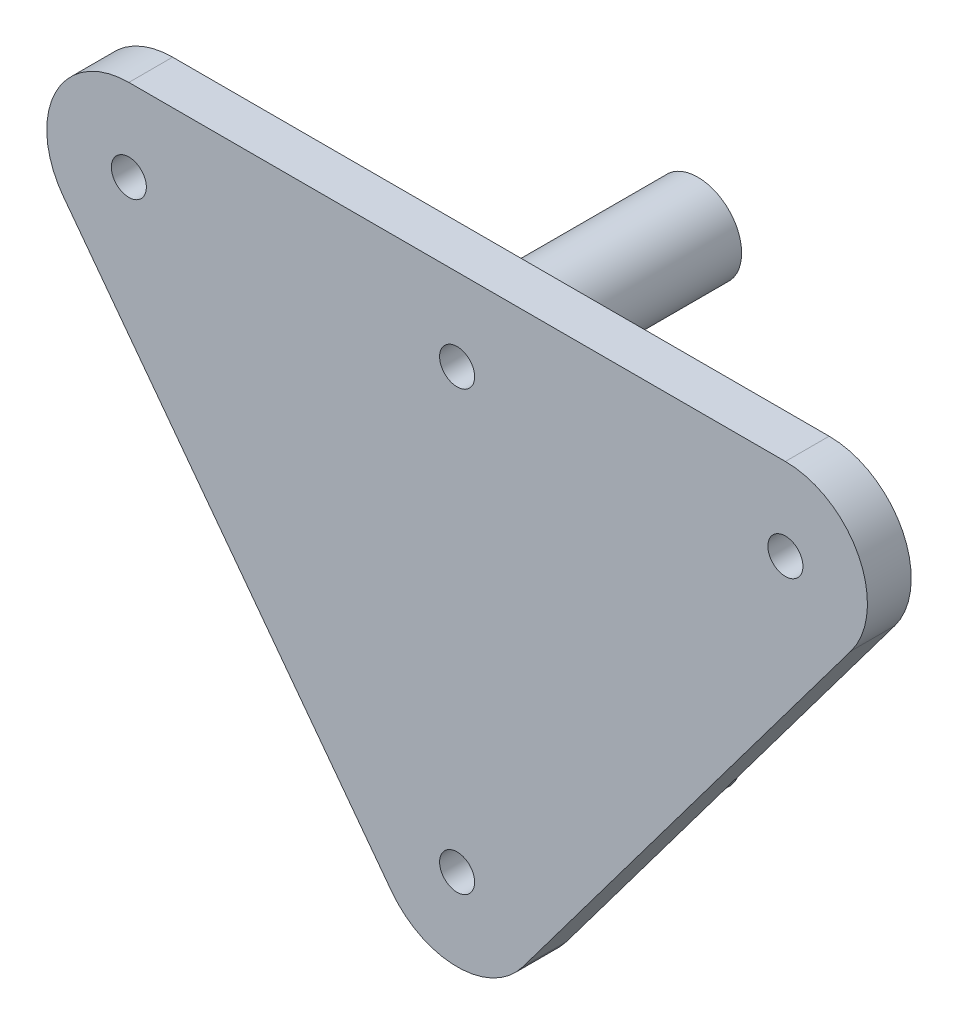
ISO-10303-21;
HEADER;
FILE_DESCRIPTION(('STEP AP214'),'2;1');
FILE_NAME('part.step','',(''),(''),'','','');
FILE_SCHEMA(('AUTOMOTIVE_DESIGN { 1 0 10303 214 1 1 1 1 }'));
ENDSEC;
DATA;
#1=APPLICATION_CONTEXT('core data for automotive mechanical design processes');
#2=APPLICATION_PROTOCOL_DEFINITION('international standard','automotive_design',2000,#1);
#3=PRODUCT_CONTEXT('',#1,'mechanical');
#4=PRODUCT('Part','Part','',(#3));
#5=PRODUCT_RELATED_PRODUCT_CATEGORY('part','',(#4));
#6=PRODUCT_DEFINITION_FORMATION('','',#4);
#7=PRODUCT_DEFINITION_CONTEXT('part definition',#1,'design');
#8=PRODUCT_DEFINITION('design','',#6,#7);
#9=PRODUCT_DEFINITION_SHAPE('','',#8);
#10=(LENGTH_UNIT() NAMED_UNIT(*) SI_UNIT(.MILLI.,.METRE.));
#11=(NAMED_UNIT(*) PLANE_ANGLE_UNIT() SI_UNIT($,.RADIAN.));
#12=(NAMED_UNIT(*) SI_UNIT($,.STERADIAN.) SOLID_ANGLE_UNIT());
#13=UNCERTAINTY_MEASURE_WITH_UNIT(LENGTH_MEASURE(1.E-05),#10,'distance_accuracy_value','');
#14=(GEOMETRIC_REPRESENTATION_CONTEXT(3) GLOBAL_UNCERTAINTY_ASSIGNED_CONTEXT((#13)) GLOBAL_UNIT_ASSIGNED_CONTEXT((#10,
#11,#12)) REPRESENTATION_CONTEXT('',''));
#15=CARTESIAN_POINT('',(0.,0.,0.));
#16=DIRECTION('',(0.,0.,1.));
#17=DIRECTION('',(1.,0.,0.));
#18=AXIS2_PLACEMENT_3D('',#15,#16,#17);
#19=CARTESIAN_POINT('',(0.,0.,0.));
#20=DIRECTION('',(0.,0.,1.));
#21=DIRECTION('',(1.,0.,0.));
#22=AXIS2_PLACEMENT_3D('',#19,#20,#21);
#23=PLANE('',#22);
#24=CARTESIAN_POINT('',(0.,-20.,0.));
#25=DIRECTION('',(0.,0.,1.));
#26=DIRECTION('',(1.,0.,0.));
#27=AXIS2_PLACEMENT_3D('',#24,#25,#26);
#28=CIRCLE('',#27,6.);
#29=CARTESIAN_POINT('',(6.,-20.,0.));
#30=VERTEX_POINT('',#29);
#31=EDGE_CURVE('E163',#30,#30,#28,.T.);
#32=ORIENTED_EDGE('',*,*,#31,.T.);
#33=EDGE_LOOP('',(#32));
#34=FACE_BOUND('',#33,.T.);
#35=CARTESIAN_POINT('',(0.,20.,0.));
#36=DIRECTION('',(0.,0.,1.));
#37=DIRECTION('',(1.,0.,0.));
#38=AXIS2_PLACEMENT_3D('',#35,#36,#37);
#39=CIRCLE('',#38,6.);
#40=CARTESIAN_POINT('',(6.,20.,0.));
#41=VERTEX_POINT('',#40);
#42=EDGE_CURVE('E160',#41,#41,#39,.T.);
#43=ORIENTED_EDGE('',*,*,#42,.T.);
#44=EDGE_LOOP('',(#43));
#45=FACE_BOUND('',#44,.T.);
#46=CARTESIAN_POINT('',(30.,20.,0.));
#47=DIRECTION('',(0.,0.,1.));
#48=DIRECTION('',(1.,0.,0.));
#49=AXIS2_PLACEMENT_3D('',#46,#47,#48);
#50=CIRCLE('',#49,3.6);
#51=CARTESIAN_POINT('',(33.6,20.,0.));
#52=VERTEX_POINT('',#51);
#53=EDGE_CURVE('E154',#52,#52,#50,.F.);
#54=ORIENTED_EDGE('',*,*,#53,.F.);
#55=EDGE_LOOP('',(#54));
#56=FACE_BOUND('',#55,.T.);
#57=CARTESIAN_POINT('',(-30.,20.,0.));
#58=DIRECTION('',(0.,0.,1.));
#59=DIRECTION('',(1.,0.,0.));
#60=AXIS2_PLACEMENT_3D('',#57,#58,#59);
#61=CIRCLE('',#60,7.5);
#62=CARTESIAN_POINT('',(-30.,27.5,0.));
#63=VERTEX_POINT('',#62);
#64=CARTESIAN_POINT('',(-36.,15.5,0.));
#65=VERTEX_POINT('',#64);
#66=EDGE_CURVE('E132',#63,#65,#61,.T.);
#67=ORIENTED_EDGE('',*,*,#66,.F.);
#68=DIRECTION('',(1.,0.,0.));
#69=VECTOR('',#68,1.);
#70=CARTESIAN_POINT('',(0.,27.5,0.));
#71=LINE('',#70,#69);
#72=CARTESIAN_POINT('',(30.,27.5,0.));
#73=VERTEX_POINT('',#72);
#74=EDGE_CURVE('E142',#63,#73,#71,.T.);
#75=ORIENTED_EDGE('',*,*,#74,.T.);
#76=CARTESIAN_POINT('',(30.,20.,0.));
#77=DIRECTION('',(0.,0.,1.));
#78=DIRECTION('',(1.,0.,0.));
#79=AXIS2_PLACEMENT_3D('',#76,#77,#78);
#80=CIRCLE('',#79,7.5);
#81=CARTESIAN_POINT('',(36.,15.5,0.));
#82=VERTEX_POINT('',#81);
#83=EDGE_CURVE('E140',#82,#73,#80,.T.);
#84=ORIENTED_EDGE('',*,*,#83,.F.);
#85=DIRECTION('',(0.6,0.8,0.));
#86=VECTOR('',#85,1.);
#87=CARTESIAN_POINT('',(15.6,-11.7,0.));
#88=LINE('',#87,#86);
#89=CARTESIAN_POINT('',(6.,-24.5,0.));
#90=VERTEX_POINT('',#89);
#91=EDGE_CURVE('E112',#90,#82,#88,.T.);
#92=ORIENTED_EDGE('',*,*,#91,.F.);
#93=CARTESIAN_POINT('',(0.,-20.,0.));
#94=DIRECTION('',(0.,0.,1.));
#95=DIRECTION('',(1.,0.,0.));
#96=AXIS2_PLACEMENT_3D('',#93,#94,#95);
#97=CIRCLE('',#96,7.5);
#98=CARTESIAN_POINT('',(-6.,-24.5,0.));
#99=VERTEX_POINT('',#98);
#100=EDGE_CURVE('E137',#99,#90,#97,.T.);
#101=ORIENTED_EDGE('',*,*,#100,.F.);
#102=DIRECTION('',(0.6,-0.8,0.));
#103=VECTOR('',#102,1.);
#104=CARTESIAN_POINT('',(-15.6,-11.7,0.));
#105=LINE('',#104,#103);
#106=EDGE_CURVE('E134',#65,#99,#105,.T.);
#107=ORIENTED_EDGE('',*,*,#106,.F.);
#108=EDGE_LOOP('',(#67,#75,#84,#92,#101,#107));
#109=FACE_BOUND('',#108,.T.);
#110=CARTESIAN_POINT('',(-30.,20.,0.));
#111=DIRECTION('',(0.,0.,1.));
#112=DIRECTION('',(1.,0.,0.));
#113=AXIS2_PLACEMENT_3D('',#110,#111,#112);
#114=CIRCLE('',#113,3.6);
#115=CARTESIAN_POINT('',(-26.4,20.,0.));
#116=VERTEX_POINT('',#115);
#117=EDGE_CURVE('E157',#116,#116,#114,.F.);
#118=ORIENTED_EDGE('',*,*,#117,.F.);
#119=EDGE_LOOP('',(#118));
#120=FACE_BOUND('',#119,.T.);
#121=ADVANCED_FACE('F35',(#34,#45,#56,#109,#120),#23,.F.);
#122=CARTESIAN_POINT('',(-30.,20.,4.));
#123=DIRECTION('',(0.,0.,-1.));
#124=DIRECTION('',(-1.,0.,0.));
#125=AXIS2_PLACEMENT_3D('',#122,#123,#124);
#126=CYLINDRICAL_SURFACE('',#125,7.5);
#127=ORIENTED_EDGE('',*,*,#66,.T.);
#128=DIRECTION('',(0.,0.,-1.));
#129=VECTOR('',#128,1.);
#130=CARTESIAN_POINT('',(-36.,15.5,4.));
#131=LINE('',#130,#129);
#132=CARTESIAN_POINT('',(-36.,15.5,4.));
#133=VERTEX_POINT('',#132);
#134=EDGE_CURVE('E152',#133,#65,#131,.T.);
#135=ORIENTED_EDGE('',*,*,#134,.F.);
#136=CARTESIAN_POINT('',(-30.,20.,4.));
#137=DIRECTION('',(0.,0.,1.));
#138=DIRECTION('',(1.,0.,0.));
#139=AXIS2_PLACEMENT_3D('',#136,#137,#138);
#140=CIRCLE('',#139,7.5);
#141=CARTESIAN_POINT('',(-30.,27.5,4.));
#142=VERTEX_POINT('',#141);
#143=EDGE_CURVE('E287',#142,#133,#140,.T.);
#144=ORIENTED_EDGE('',*,*,#143,.F.);
#145=DIRECTION('',(0.,0.,-1.));
#146=VECTOR('',#145,1.);
#147=CARTESIAN_POINT('',(-30.,27.5,4.));
#148=LINE('',#147,#146);
#149=EDGE_CURVE('E52',#142,#63,#148,.T.);
#150=ORIENTED_EDGE('',*,*,#149,.T.);
#151=EDGE_LOOP('',(#127,#135,#144,#150));
#152=FACE_BOUND('',#151,.T.);
#153=ADVANCED_FACE('F179',(#152),#126,.T.);
#154=CARTESIAN_POINT('',(-15.6,-11.7,4.));
#155=DIRECTION('',(0.8,0.6,0.));
#156=DIRECTION('',(-0.6,0.8,0.));
#157=AXIS2_PLACEMENT_3D('',#154,#155,#156);
#158=PLANE('',#157);
#159=ORIENTED_EDGE('',*,*,#106,.T.);
#160=DIRECTION('',(0.,0.,-1.));
#161=VECTOR('',#160,1.);
#162=CARTESIAN_POINT('',(-6.,-24.5,4.));
#163=LINE('',#162,#161);
#164=CARTESIAN_POINT('',(-6.,-24.5,4.));
#165=VERTEX_POINT('',#164);
#166=EDGE_CURVE('E149',#165,#99,#163,.T.);
#167=ORIENTED_EDGE('',*,*,#166,.F.);
#168=DIRECTION('',(0.6,-0.8,0.));
#169=VECTOR('',#168,1.);
#170=CARTESIAN_POINT('',(-15.6,-11.7,4.));
#171=LINE('',#170,#169);
#172=EDGE_CURVE('E86',#133,#165,#171,.T.);
#173=ORIENTED_EDGE('',*,*,#172,.F.);
#174=ORIENTED_EDGE('',*,*,#134,.T.);
#175=EDGE_LOOP('',(#159,#167,#173,#174));
#176=FACE_BOUND('',#175,.T.);
#177=ADVANCED_FACE('F247',(#176),#158,.F.);
#178=CARTESIAN_POINT('',(0.,-20.,4.));
#179=DIRECTION('',(0.,0.,-1.));
#180=DIRECTION('',(-1.,0.,0.));
#181=AXIS2_PLACEMENT_3D('',#178,#179,#180);
#182=CYLINDRICAL_SURFACE('',#181,7.5);
#183=ORIENTED_EDGE('',*,*,#100,.T.);
#184=DIRECTION('',(0.,0.,-1.));
#185=VECTOR('',#184,1.);
#186=CARTESIAN_POINT('',(6.,-24.5,4.));
#187=LINE('',#186,#185);
#188=CARTESIAN_POINT('',(6.,-24.5,4.));
#189=VERTEX_POINT('',#188);
#190=EDGE_CURVE('E115',#189,#90,#187,.T.);
#191=ORIENTED_EDGE('',*,*,#190,.F.);
#192=CARTESIAN_POINT('',(0.,-20.,4.));
#193=DIRECTION('',(0.,0.,1.));
#194=DIRECTION('',(1.,0.,0.));
#195=AXIS2_PLACEMENT_3D('',#192,#193,#194);
#196=CIRCLE('',#195,7.5);
#197=EDGE_CURVE('E103',#165,#189,#196,.T.);
#198=ORIENTED_EDGE('',*,*,#197,.F.);
#199=ORIENTED_EDGE('',*,*,#166,.T.);
#200=EDGE_LOOP('',(#183,#191,#198,#199));
#201=FACE_BOUND('',#200,.T.);
#202=ADVANCED_FACE('F244',(#201),#182,.T.);
#203=CARTESIAN_POINT('',(15.6,-11.7,4.));
#204=DIRECTION('',(-0.8,0.6,0.));
#205=DIRECTION('',(-0.6,-0.8,0.));
#206=AXIS2_PLACEMENT_3D('',#203,#204,#205);
#207=PLANE('',#206);
#208=ORIENTED_EDGE('',*,*,#91,.T.);
#209=DIRECTION('',(0.,0.,-1.));
#210=VECTOR('',#209,1.);
#211=CARTESIAN_POINT('',(36.,15.5,4.));
#212=LINE('',#211,#210);
#213=CARTESIAN_POINT('',(36.,15.5,4.));
#214=VERTEX_POINT('',#213);
#215=EDGE_CURVE('E109',#214,#82,#212,.T.);
#216=ORIENTED_EDGE('',*,*,#215,.F.);
#217=DIRECTION('',(0.6,0.8,0.));
#218=VECTOR('',#217,1.);
#219=CARTESIAN_POINT('',(15.6,-11.7,4.));
#220=LINE('',#219,#218);
#221=EDGE_CURVE('E95',#189,#214,#220,.T.);
#222=ORIENTED_EDGE('',*,*,#221,.F.);
#223=ORIENTED_EDGE('',*,*,#190,.T.);
#224=EDGE_LOOP('',(#208,#216,#222,#223));
#225=FACE_BOUND('',#224,.T.);
#226=ADVANCED_FACE('F110',(#225),#207,.F.);
#227=CARTESIAN_POINT('',(30.,20.,4.));
#228=DIRECTION('',(0.,0.,-1.));
#229=DIRECTION('',(-1.,0.,0.));
#230=AXIS2_PLACEMENT_3D('',#227,#228,#229);
#231=CYLINDRICAL_SURFACE('',#230,7.5);
#232=ORIENTED_EDGE('',*,*,#83,.T.);
#233=DIRECTION('',(0.,0.,-1.));
#234=VECTOR('',#233,1.);
#235=CARTESIAN_POINT('',(30.,27.5,4.));
#236=LINE('',#235,#234);
#237=CARTESIAN_POINT('',(30.,27.5,4.));
#238=VERTEX_POINT('',#237);
#239=EDGE_CURVE('E73',#238,#73,#236,.T.);
#240=ORIENTED_EDGE('',*,*,#239,.F.);
#241=CARTESIAN_POINT('',(30.,20.,4.));
#242=DIRECTION('',(0.,0.,1.));
#243=DIRECTION('',(1.,0.,0.));
#244=AXIS2_PLACEMENT_3D('',#241,#242,#243);
#245=CIRCLE('',#244,7.5);
#246=EDGE_CURVE('E101',#214,#238,#245,.T.);
#247=ORIENTED_EDGE('',*,*,#246,.F.);
#248=ORIENTED_EDGE('',*,*,#215,.T.);
#249=EDGE_LOOP('',(#232,#240,#247,#248));
#250=FACE_BOUND('',#249,.T.);
#251=ADVANCED_FACE('F117',(#250),#231,.T.);
#252=CARTESIAN_POINT('',(0.,-20.,4.));
#253=DIRECTION('',(0.,0.,-1.));
#254=DIRECTION('',(-1.,0.,0.));
#255=AXIS2_PLACEMENT_3D('',#252,#253,#254);
#256=CYLINDRICAL_SURFACE('',#255,1.6);
#257=CARTESIAN_POINT('',(0.,-20.,4.));
#258=DIRECTION('',(0.,0.,1.));
#259=DIRECTION('',(1.,0.,0.));
#260=AXIS2_PLACEMENT_3D('',#257,#258,#259);
#261=CIRCLE('',#260,1.6);
#262=CARTESIAN_POINT('',(1.6,-20.,4.));
#263=VERTEX_POINT('',#262);
#264=EDGE_CURVE('E126',#263,#263,#261,.T.);
#265=ORIENTED_EDGE('',*,*,#264,.T.);
#266=EDGE_LOOP('',(#265));
#267=FACE_BOUND('',#266,.T.);
#268=CARTESIAN_POINT('',(0.,-20.,-18.));
#269=DIRECTION('',(0.,0.,-1.));
#270=DIRECTION('',(-1.,0.,0.));
#271=AXIS2_PLACEMENT_3D('',#268,#269,#270);
#272=CIRCLE('',#271,1.6);
#273=CARTESIAN_POINT('',(-1.6,-20.,-18.));
#274=VERTEX_POINT('',#273);
#275=EDGE_CURVE('E275',#274,#274,#272,.T.);
#276=ORIENTED_EDGE('',*,*,#275,.T.);
#277=EDGE_LOOP('',(#276));
#278=FACE_BOUND('',#277,.T.);
#279=ADVANCED_FACE('F229',(#267,#278),#256,.F.);
#280=CARTESIAN_POINT('',(30.,20.,4.));
#281=DIRECTION('',(0.,0.,-1.));
#282=DIRECTION('',(-1.,0.,0.));
#283=AXIS2_PLACEMENT_3D('',#280,#281,#282);
#284=CYLINDRICAL_SURFACE('',#283,1.6);
#285=CARTESIAN_POINT('',(30.,20.,4.));
#286=DIRECTION('',(0.,0.,1.));
#287=DIRECTION('',(1.,0.,0.));
#288=AXIS2_PLACEMENT_3D('',#285,#286,#287);
#289=CIRCLE('',#288,1.6);
#290=CARTESIAN_POINT('',(31.6,20.,4.));
#291=VERTEX_POINT('',#290);
#292=EDGE_CURVE('E120',#291,#291,#289,.T.);
#293=ORIENTED_EDGE('',*,*,#292,.T.);
#294=EDGE_LOOP('',(#293));
#295=FACE_BOUND('',#294,.T.);
#296=CARTESIAN_POINT('',(30.,20.,-0.5));
#297=DIRECTION('',(0.,0.,-1.));
#298=DIRECTION('',(-1.,0.,0.));
#299=AXIS2_PLACEMENT_3D('',#296,#297,#298);
#300=CIRCLE('',#299,1.6);
#301=CARTESIAN_POINT('',(28.4,20.,-0.5));
#302=VERTEX_POINT('',#301);
#303=EDGE_CURVE('E267',#302,#302,#300,.T.);
#304=ORIENTED_EDGE('',*,*,#303,.T.);
#305=EDGE_LOOP('',(#304));
#306=FACE_BOUND('',#305,.T.);
#307=ADVANCED_FACE('F232',(#295,#306),#284,.F.);
#308=CARTESIAN_POINT('',(0.,27.5,4.));
#309=DIRECTION('',(0.,1.,0.));
#310=DIRECTION('',(0.,0.,1.));
#311=AXIS2_PLACEMENT_3D('',#308,#309,#310);
#312=PLANE('',#311);
#313=ORIENTED_EDGE('',*,*,#74,.F.);
#314=ORIENTED_EDGE('',*,*,#149,.F.);
#315=DIRECTION('',(1.,0.,0.));
#316=VECTOR('',#315,1.);
#317=CARTESIAN_POINT('',(0.,27.5,4.));
#318=LINE('',#317,#316);
#319=EDGE_CURVE('E118',#142,#238,#318,.T.);
#320=ORIENTED_EDGE('',*,*,#319,.T.);
#321=ORIENTED_EDGE('',*,*,#239,.T.);
#322=EDGE_LOOP('',(#313,#314,#320,#321));
#323=FACE_BOUND('',#322,.T.);
#324=ADVANCED_FACE('F236',(#323),#312,.T.);
#325=CARTESIAN_POINT('',(-30.,20.,4.));
#326=DIRECTION('',(0.,0.,-1.));
#327=DIRECTION('',(-1.,0.,0.));
#328=AXIS2_PLACEMENT_3D('',#325,#326,#327);
#329=CYLINDRICAL_SURFACE('',#328,1.6);
#330=CARTESIAN_POINT('',(-30.,20.,4.));
#331=DIRECTION('',(0.,0.,1.));
#332=DIRECTION('',(1.,0.,0.));
#333=AXIS2_PLACEMENT_3D('',#330,#331,#332);
#334=CIRCLE('',#333,1.6);
#335=CARTESIAN_POINT('',(-28.4,20.,4.));
#336=VERTEX_POINT('',#335);
#337=EDGE_CURVE('E145',#336,#336,#334,.T.);
#338=ORIENTED_EDGE('',*,*,#337,.T.);
#339=EDGE_LOOP('',(#338));
#340=FACE_BOUND('',#339,.T.);
#341=CARTESIAN_POINT('',(-30.,20.,-0.5));
#342=DIRECTION('',(0.,0.,-1.));
#343=DIRECTION('',(-1.,0.,0.));
#344=AXIS2_PLACEMENT_3D('',#341,#342,#343);
#345=CIRCLE('',#344,1.6);
#346=CARTESIAN_POINT('',(-31.6,20.,-0.5));
#347=VERTEX_POINT('',#346);
#348=EDGE_CURVE('E262',#347,#347,#345,.T.);
#349=ORIENTED_EDGE('',*,*,#348,.T.);
#350=EDGE_LOOP('',(#349));
#351=FACE_BOUND('',#350,.T.);
#352=ADVANCED_FACE('F227',(#340,#351),#329,.F.);
#353=CARTESIAN_POINT('',(0.,20.,4.));
#354=DIRECTION('',(0.,0.,-1.));
#355=DIRECTION('',(-1.,0.,0.));
#356=AXIS2_PLACEMENT_3D('',#353,#354,#355);
#357=CYLINDRICAL_SURFACE('',#356,1.6);
#358=CARTESIAN_POINT('',(0.,20.,4.));
#359=DIRECTION('',(0.,0.,1.));
#360=DIRECTION('',(1.,0.,0.));
#361=AXIS2_PLACEMENT_3D('',#358,#359,#360);
#362=CIRCLE('',#361,1.6);
#363=CARTESIAN_POINT('',(1.6,20.,4.));
#364=VERTEX_POINT('',#363);
#365=EDGE_CURVE('E129',#364,#364,#362,.T.);
#366=ORIENTED_EDGE('',*,*,#365,.T.);
#367=EDGE_LOOP('',(#366));
#368=FACE_BOUND('',#367,.T.);
#369=CARTESIAN_POINT('',(0.,20.,-18.));
#370=DIRECTION('',(0.,0.,-1.));
#371=DIRECTION('',(-1.,0.,0.));
#372=AXIS2_PLACEMENT_3D('',#369,#370,#371);
#373=CIRCLE('',#372,1.6);
#374=CARTESIAN_POINT('',(-1.6,20.,-18.));
#375=VERTEX_POINT('',#374);
#376=EDGE_CURVE('E281',#375,#375,#373,.T.);
#377=ORIENTED_EDGE('',*,*,#376,.T.);
#378=EDGE_LOOP('',(#377));
#379=FACE_BOUND('',#378,.T.);
#380=ADVANCED_FACE('F222',(#368,#379),#357,.F.);
#381=CARTESIAN_POINT('',(0.,0.,4.));
#382=DIRECTION('',(0.,0.,1.));
#383=DIRECTION('',(1.,0.,0.));
#384=AXIS2_PLACEMENT_3D('',#381,#382,#383);
#385=PLANE('',#384);
#386=ORIENTED_EDGE('',*,*,#337,.F.);
#387=EDGE_LOOP('',(#386));
#388=FACE_BOUND('',#387,.T.);
#389=ORIENTED_EDGE('',*,*,#143,.T.);
#390=ORIENTED_EDGE('',*,*,#172,.T.);
#391=ORIENTED_EDGE('',*,*,#197,.T.);
#392=ORIENTED_EDGE('',*,*,#221,.T.);
#393=ORIENTED_EDGE('',*,*,#246,.T.);
#394=ORIENTED_EDGE('',*,*,#319,.F.);
#395=EDGE_LOOP('',(#389,#390,#391,#392,#393,#394));
#396=FACE_BOUND('',#395,.T.);
#397=ORIENTED_EDGE('',*,*,#292,.F.);
#398=EDGE_LOOP('',(#397));
#399=FACE_BOUND('',#398,.T.);
#400=ORIENTED_EDGE('',*,*,#264,.F.);
#401=EDGE_LOOP('',(#400));
#402=FACE_BOUND('',#401,.T.);
#403=ORIENTED_EDGE('',*,*,#365,.F.);
#404=EDGE_LOOP('',(#403));
#405=FACE_BOUND('',#404,.T.);
#406=ADVANCED_FACE('F97',(#388,#396,#399,#402,#405),#385,.T.);
#407=CARTESIAN_POINT('',(0.,20.,-29.3137084989848));
#408=DIRECTION('',(0.,0.,1.));
#409=DIRECTION('',(1.,0.,0.));
#410=AXIS2_PLACEMENT_3D('',#407,#408,#409);
#411=CYLINDRICAL_SURFACE('',#410,4.);
#412=CARTESIAN_POINT('',(0.,20.,-2.));
#413=DIRECTION('',(0.,0.,1.));
#414=DIRECTION('',(1.,0.,0.));
#415=AXIS2_PLACEMENT_3D('',#412,#413,#414);
#416=CIRCLE('',#415,4.);
#417=CARTESIAN_POINT('',(4.,20.,-2.));
#418=VERTEX_POINT('',#417);
#419=EDGE_CURVE('E11',#418,#418,#416,.F.);
#420=ORIENTED_EDGE('',*,*,#419,.T.);
#421=EDGE_LOOP('',(#420));
#422=FACE_BOUND('',#421,.T.);
#423=CARTESIAN_POINT('',(0.,20.,-18.));
#424=DIRECTION('',(0.,0.,-1.));
#425=DIRECTION('',(-1.,0.,0.));
#426=AXIS2_PLACEMENT_3D('',#423,#424,#425);
#427=CIRCLE('',#426,4.);
#428=CARTESIAN_POINT('',(-4.,20.,-18.));
#429=VERTEX_POINT('',#428);
#430=EDGE_CURVE('E135',#429,#429,#427,.F.);
#431=ORIENTED_EDGE('',*,*,#430,.T.);
#432=EDGE_LOOP('',(#431));
#433=FACE_BOUND('',#432,.T.);
#434=ADVANCED_FACE('F216',(#422,#433),#411,.T.);
#435=CARTESIAN_POINT('',(0.,0.,-18.));
#436=DIRECTION('',(0.,0.,-1.));
#437=DIRECTION('',(-1.,0.,0.));
#438=AXIS2_PLACEMENT_3D('',#435,#436,#437);
#439=PLANE('',#438);
#440=ORIENTED_EDGE('',*,*,#430,.F.);
#441=EDGE_LOOP('',(#440));
#442=FACE_BOUND('',#441,.T.);
#443=ORIENTED_EDGE('',*,*,#376,.F.);
#444=EDGE_LOOP('',(#443));
#445=FACE_BOUND('',#444,.T.);
#446=ADVANCED_FACE('F213',(#442,#445),#439,.T.);
#447=CARTESIAN_POINT('',(0.,-20.,-29.3137084989848));
#448=DIRECTION('',(0.,0.,1.));
#449=DIRECTION('',(1.,0.,0.));
#450=AXIS2_PLACEMENT_3D('',#447,#448,#449);
#451=CYLINDRICAL_SURFACE('',#450,4.);
#452=CARTESIAN_POINT('',(0.,-20.,-2.));
#453=DIRECTION('',(0.,0.,1.));
#454=DIRECTION('',(1.,0.,0.));
#455=AXIS2_PLACEMENT_3D('',#452,#453,#454);
#456=CIRCLE('',#455,4.);
#457=CARTESIAN_POINT('',(4.,-20.,-2.));
#458=VERTEX_POINT('',#457);
#459=EDGE_CURVE('E44',#458,#458,#456,.F.);
#460=ORIENTED_EDGE('',*,*,#459,.T.);
#461=EDGE_LOOP('',(#460));
#462=FACE_BOUND('',#461,.T.);
#463=CARTESIAN_POINT('',(0.,-20.,-18.));
#464=DIRECTION('',(0.,0.,-1.));
#465=DIRECTION('',(-1.,0.,0.));
#466=AXIS2_PLACEMENT_3D('',#463,#464,#465);
#467=CIRCLE('',#466,4.);
#468=CARTESIAN_POINT('',(-4.,-20.,-18.));
#469=VERTEX_POINT('',#468);
#470=EDGE_CURVE('E278',#469,#469,#467,.F.);
#471=ORIENTED_EDGE('',*,*,#470,.T.);
#472=EDGE_LOOP('',(#471));
#473=FACE_BOUND('',#472,.T.);
#474=ADVANCED_FACE('F168',(#462,#473),#451,.T.);
#475=CARTESIAN_POINT('',(0.,0.,-18.));
#476=DIRECTION('',(0.,0.,-1.));
#477=DIRECTION('',(-1.,0.,0.));
#478=AXIS2_PLACEMENT_3D('',#475,#476,#477);
#479=PLANE('',#478);
#480=ORIENTED_EDGE('',*,*,#470,.F.);
#481=EDGE_LOOP('',(#480));
#482=FACE_BOUND('',#481,.T.);
#483=ORIENTED_EDGE('',*,*,#275,.F.);
#484=EDGE_LOOP('',(#483));
#485=FACE_BOUND('',#484,.T.);
#486=ADVANCED_FACE('F203',(#482,#485),#479,.T.);
#487=CARTESIAN_POINT('',(30.,20.,-0.5));
#488=DIRECTION('',(0.,0.,-1.));
#489=DIRECTION('',(-1.,0.,0.));
#490=AXIS2_PLACEMENT_3D('',#487,#488,#489);
#491=PLANE('',#490);
#492=CARTESIAN_POINT('',(30.,20.,-0.5));
#493=DIRECTION('',(0.,0.,-1.));
#494=DIRECTION('',(-1.,0.,0.));
#495=AXIS2_PLACEMENT_3D('',#492,#493,#494);
#496=CIRCLE('',#495,3.6);
#497=CARTESIAN_POINT('',(26.4,20.,-0.5));
#498=VERTEX_POINT('',#497);
#499=EDGE_CURVE('E272',#498,#498,#496,.T.);
#500=ORIENTED_EDGE('',*,*,#499,.T.);
#501=EDGE_LOOP('',(#500));
#502=FACE_BOUND('',#501,.T.);
#503=ORIENTED_EDGE('',*,*,#303,.F.);
#504=EDGE_LOOP('',(#503));
#505=FACE_BOUND('',#504,.T.);
#506=ADVANCED_FACE('F200',(#502,#505),#491,.T.);
#507=CARTESIAN_POINT('',(30.,20.,-0.5));
#508=DIRECTION('',(0.,0.,1.));
#509=DIRECTION('',(1.,0.,0.));
#510=AXIS2_PLACEMENT_3D('',#507,#508,#509);
#511=CYLINDRICAL_SURFACE('',#510,3.6);
#512=ORIENTED_EDGE('',*,*,#499,.F.);
#513=EDGE_LOOP('',(#512));
#514=FACE_BOUND('',#513,.T.);
#515=ORIENTED_EDGE('',*,*,#53,.T.);
#516=EDGE_LOOP('',(#515));
#517=FACE_BOUND('',#516,.T.);
#518=ADVANCED_FACE('F195',(#514,#517),#511,.T.);
#519=CARTESIAN_POINT('',(-30.,20.,-0.5));
#520=DIRECTION('',(0.,0.,-1.));
#521=DIRECTION('',(-1.,0.,0.));
#522=AXIS2_PLACEMENT_3D('',#519,#520,#521);
#523=PLANE('',#522);
#524=CARTESIAN_POINT('',(-30.,20.,-0.5));
#525=DIRECTION('',(0.,0.,-1.));
#526=DIRECTION('',(-1.,0.,0.));
#527=AXIS2_PLACEMENT_3D('',#524,#525,#526);
#528=CIRCLE('',#527,3.6);
#529=CARTESIAN_POINT('',(-33.6,20.,-0.5));
#530=VERTEX_POINT('',#529);
#531=EDGE_CURVE('E264',#530,#530,#528,.T.);
#532=ORIENTED_EDGE('',*,*,#531,.T.);
#533=EDGE_LOOP('',(#532));
#534=FACE_BOUND('',#533,.T.);
#535=ORIENTED_EDGE('',*,*,#348,.F.);
#536=EDGE_LOOP('',(#535));
#537=FACE_BOUND('',#536,.T.);
#538=ADVANCED_FACE('F189',(#534,#537),#523,.T.);
#539=CARTESIAN_POINT('',(-30.,20.,-0.5));
#540=DIRECTION('',(0.,0.,1.));
#541=DIRECTION('',(1.,0.,0.));
#542=AXIS2_PLACEMENT_3D('',#539,#540,#541);
#543=CYLINDRICAL_SURFACE('',#542,3.6);
#544=ORIENTED_EDGE('',*,*,#531,.F.);
#545=EDGE_LOOP('',(#544));
#546=FACE_BOUND('',#545,.T.);
#547=ORIENTED_EDGE('',*,*,#117,.T.);
#548=EDGE_LOOP('',(#547));
#549=FACE_BOUND('',#548,.T.);
#550=ADVANCED_FACE('F174',(#546,#549),#543,.T.);
#551=CARTESIAN_POINT('',(0.,-20.,-2.));
#552=DIRECTION('',(0.,0.,1.));
#553=DIRECTION('',(1.,0.,0.));
#554=AXIS2_PLACEMENT_3D('',#551,#552,#553);
#555=TOROIDAL_SURFACE('',#554,6.,2.);
#556=ORIENTED_EDGE('',*,*,#459,.F.);
#557=EDGE_LOOP('',(#556));
#558=FACE_BOUND('',#557,.T.);
#559=ORIENTED_EDGE('',*,*,#31,.F.);
#560=EDGE_LOOP('',(#559));
#561=FACE_BOUND('',#560,.T.);
#562=ADVANCED_FACE('F171',(#558,#561),#555,.F.);
#563=CARTESIAN_POINT('',(0.,20.,-2.));
#564=DIRECTION('',(0.,0.,1.));
#565=DIRECTION('',(1.,0.,0.));
#566=AXIS2_PLACEMENT_3D('',#563,#564,#565);
#567=TOROIDAL_SURFACE('',#566,6.,2.);
#568=ORIENTED_EDGE('',*,*,#419,.F.);
#569=EDGE_LOOP('',(#568));
#570=FACE_BOUND('',#569,.T.);
#571=ORIENTED_EDGE('',*,*,#42,.F.);
#572=EDGE_LOOP('',(#571));
#573=FACE_BOUND('',#572,.T.);
#574=ADVANCED_FACE('F37',(#570,#573),#567,.F.);
#575=CLOSED_SHELL('',(#121,#153,#177,#202,#226,#251,#279,#307,#324,#352,#380,#406,#434,#446,
#474,#486,#506,#518,#538,#550,#562,#574));
#576=MANIFOLD_SOLID_BREP('B2',#575);
#577=ADVANCED_BREP_SHAPE_REPRESENTATION('',(#18,#576),#14);
#578=SHAPE_DEFINITION_REPRESENTATION(#9,#577);
ENDSEC;
END-ISO-10303-21;
